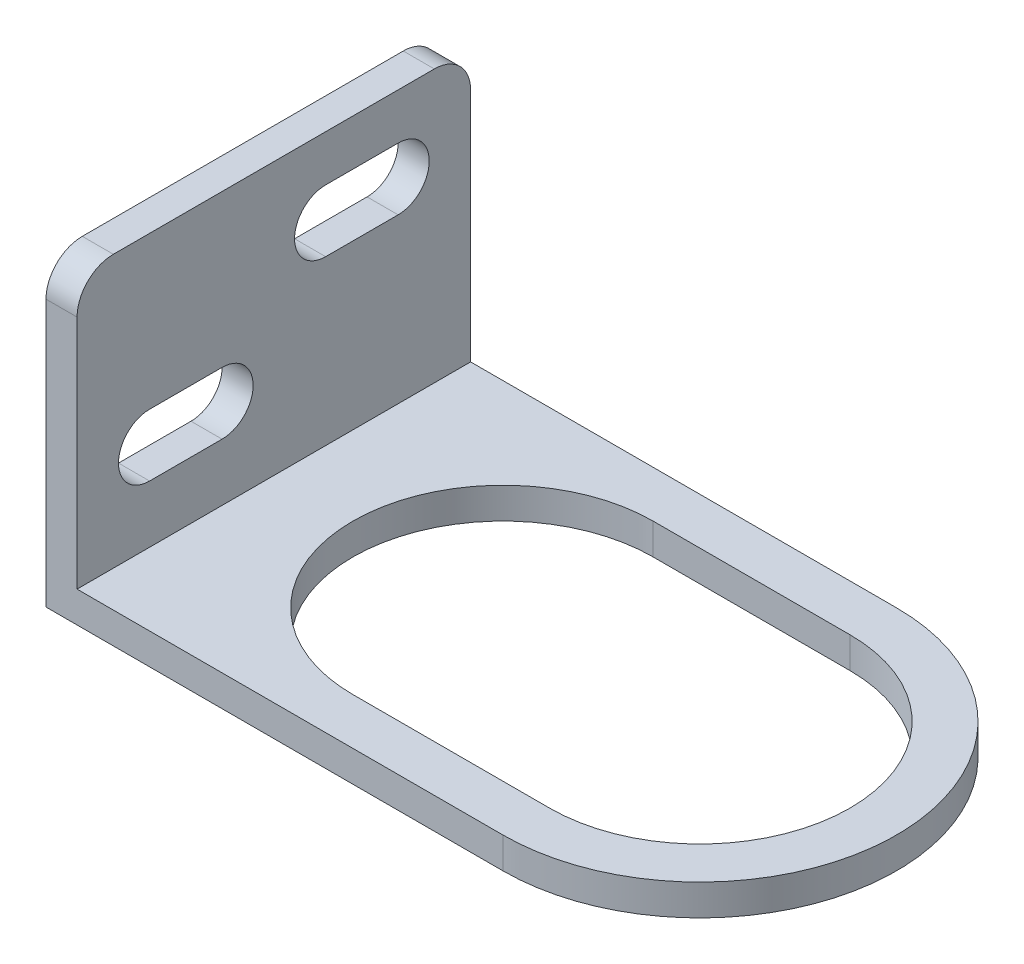
ISO-10303-21;
HEADER;
FILE_DESCRIPTION(('STEP AP214'),'2;1');
FILE_NAME('part.step','',(''),(''),'','','');
FILE_SCHEMA(('AUTOMOTIVE_DESIGN { 1 0 10303 214 1 1 1 1 }'));
ENDSEC;
DATA;
#1=APPLICATION_CONTEXT('core data for automotive mechanical design processes');
#2=APPLICATION_PROTOCOL_DEFINITION('international standard','automotive_design',2000,#1);
#3=PRODUCT_CONTEXT('',#1,'mechanical');
#4=PRODUCT('Part','Part','',(#3));
#5=PRODUCT_RELATED_PRODUCT_CATEGORY('part','',(#4));
#6=PRODUCT_DEFINITION_FORMATION('','',#4);
#7=PRODUCT_DEFINITION_CONTEXT('part definition',#1,'design');
#8=PRODUCT_DEFINITION('design','',#6,#7);
#9=PRODUCT_DEFINITION_SHAPE('','',#8);
#10=(LENGTH_UNIT() NAMED_UNIT(*) SI_UNIT(.MILLI.,.METRE.));
#11=(NAMED_UNIT(*) PLANE_ANGLE_UNIT() SI_UNIT($,.RADIAN.));
#12=(NAMED_UNIT(*) SI_UNIT($,.STERADIAN.) SOLID_ANGLE_UNIT());
#13=UNCERTAINTY_MEASURE_WITH_UNIT(LENGTH_MEASURE(1.E-05),#10,'distance_accuracy_value','');
#14=(GEOMETRIC_REPRESENTATION_CONTEXT(3) GLOBAL_UNCERTAINTY_ASSIGNED_CONTEXT((#13)) GLOBAL_UNIT_ASSIGNED_CONTEXT((#10,
#11,#12)) REPRESENTATION_CONTEXT('',''));
#15=CARTESIAN_POINT('',(0.,0.,0.));
#16=DIRECTION('',(0.,0.,1.));
#17=DIRECTION('',(1.,0.,0.));
#18=AXIS2_PLACEMENT_3D('',#15,#16,#17);
#19=CARTESIAN_POINT('',(0.,0.,19.));
#20=DIRECTION('',(0.,0.,-1.));
#21=DIRECTION('',(-1.,0.,0.));
#22=AXIS2_PLACEMENT_3D('',#19,#20,#21);
#23=PLANE('',#22);
#24=DIRECTION('',(0.,1.,0.));
#25=VECTOR('',#24,1.);
#26=CARTESIAN_POINT('',(42.625671960899,-8.5,19.));
#27=LINE('',#26,#25);
#28=CARTESIAN_POINT('',(42.625671960899,-1.5,19.));
#29=VERTEX_POINT('',#28);
#30=CARTESIAN_POINT('',(42.625671960899,1.5,19.));
#31=VERTEX_POINT('',#30);
#32=EDGE_CURVE('E182',#29,#31,#27,.T.);
#33=ORIENTED_EDGE('',*,*,#32,.T.);
#34=DIRECTION('',(1.,0.,0.));
#35=VECTOR('',#34,1.);
#36=CARTESIAN_POINT('',(0.,1.5,19.));
#37=LINE('',#36,#35);
#38=CARTESIAN_POINT('',(1.5,1.5,19.));
#39=VERTEX_POINT('',#38);
#40=EDGE_CURVE('E181',#39,#31,#37,.T.);
#41=ORIENTED_EDGE('',*,*,#40,.F.);
#42=DIRECTION('',(0.,-1.,0.));
#43=VECTOR('',#42,1.);
#44=CARTESIAN_POINT('',(1.5,32.,19.));
#45=LINE('',#44,#43);
#46=CARTESIAN_POINT('',(1.5,24.2461484812615,19.));
#47=VERTEX_POINT('',#46);
#48=EDGE_CURVE('E208',#47,#39,#45,.T.);
#49=ORIENTED_EDGE('',*,*,#48,.F.);
#50=DIRECTION('',(1.,0.,0.));
#51=VECTOR('',#50,1.);
#52=CARTESIAN_POINT('',(-1.5,24.2461484812615,19.));
#53=LINE('',#52,#51);
#54=CARTESIAN_POINT('',(-1.5,24.2461484812615,19.));
#55=VERTEX_POINT('',#54);
#56=EDGE_CURVE('E219',#55,#47,#53,.T.);
#57=ORIENTED_EDGE('',*,*,#56,.F.);
#58=DIRECTION('',(0.,-1.,0.));
#59=VECTOR('',#58,1.);
#60=CARTESIAN_POINT('',(-1.5,32.,19.));
#61=LINE('',#60,#59);
#62=CARTESIAN_POINT('',(-1.5,-1.5,19.));
#63=VERTEX_POINT('',#62);
#64=EDGE_CURVE('E201',#55,#63,#61,.T.);
#65=ORIENTED_EDGE('',*,*,#64,.T.);
#66=DIRECTION('',(1.,0.,0.));
#67=VECTOR('',#66,1.);
#68=CARTESIAN_POINT('',(0.,-1.5,19.));
#69=LINE('',#68,#67);
#70=EDGE_CURVE('E198',#63,#29,#69,.T.);
#71=ORIENTED_EDGE('',*,*,#70,.T.);
#72=EDGE_LOOP('',(#33,#41,#49,#57,#65,#71));
#73=FACE_BOUND('',#72,.T.);
#74=ADVANCED_FACE('F32',(#73),#23,.F.);
#75=CARTESIAN_POINT('',(0.,0.,-19.));
#76=DIRECTION('',(0.,0.,-1.));
#77=DIRECTION('',(-1.,0.,0.));
#78=AXIS2_PLACEMENT_3D('',#75,#76,#77);
#79=PLANE('',#78);
#80=DIRECTION('',(1.,0.,0.));
#81=VECTOR('',#80,1.);
#82=CARTESIAN_POINT('',(0.,1.5,-19.));
#83=LINE('',#82,#81);
#84=CARTESIAN_POINT('',(1.5,1.5,-19.));
#85=VERTEX_POINT('',#84);
#86=CARTESIAN_POINT('',(42.625671960899,1.5,-19.));
#87=VERTEX_POINT('',#86);
#88=EDGE_CURVE('E179',#85,#87,#83,.T.);
#89=ORIENTED_EDGE('',*,*,#88,.T.);
#90=DIRECTION('',(0.,1.,0.));
#91=VECTOR('',#90,1.);
#92=CARTESIAN_POINT('',(42.625671960899,-8.5,-19.));
#93=LINE('',#92,#91);
#94=CARTESIAN_POINT('',(42.625671960899,-1.5,-19.));
#95=VERTEX_POINT('',#94);
#96=EDGE_CURVE('E11',#87,#95,#93,.F.);
#97=ORIENTED_EDGE('',*,*,#96,.T.);
#98=DIRECTION('',(1.,0.,0.));
#99=VECTOR('',#98,1.);
#100=CARTESIAN_POINT('',(0.,-1.5,-19.));
#101=LINE('',#100,#99);
#102=CARTESIAN_POINT('',(-1.5,-1.5,-19.));
#103=VERTEX_POINT('',#102);
#104=EDGE_CURVE('E189',#103,#95,#101,.T.);
#105=ORIENTED_EDGE('',*,*,#104,.F.);
#106=DIRECTION('',(0.,-1.,0.));
#107=VECTOR('',#106,1.);
#108=CARTESIAN_POINT('',(-1.5,32.,-19.));
#109=LINE('',#108,#107);
#110=CARTESIAN_POINT('',(-1.5,24.2461484812615,-19.));
#111=VERTEX_POINT('',#110);
#112=EDGE_CURVE('E191',#111,#103,#109,.T.);
#113=ORIENTED_EDGE('',*,*,#112,.F.);
#114=DIRECTION('',(1.,0.,0.));
#115=VECTOR('',#114,1.);
#116=CARTESIAN_POINT('',(-1.5,24.2461484812615,-19.));
#117=LINE('',#116,#115);
#118=CARTESIAN_POINT('',(1.5,24.2461484812615,-19.));
#119=VERTEX_POINT('',#118);
#120=EDGE_CURVE('E274',#111,#119,#117,.T.);
#121=ORIENTED_EDGE('',*,*,#120,.T.);
#122=DIRECTION('',(0.,-1.,0.));
#123=VECTOR('',#122,1.);
#124=CARTESIAN_POINT('',(1.5,32.,-19.));
#125=LINE('',#124,#123);
#126=EDGE_CURVE('E187',#119,#85,#125,.T.);
#127=ORIENTED_EDGE('',*,*,#126,.T.);
#128=EDGE_LOOP('',(#89,#97,#105,#113,#121,#127));
#129=FACE_BOUND('',#128,.T.);
#130=ADVANCED_FACE('F184',(#129),#79,.T.);
#131=CARTESIAN_POINT('',(0.,-1.5,19.));
#132=DIRECTION('',(0.,1.,0.));
#133=DIRECTION('',(0.,0.,1.));
#134=AXIS2_PLACEMENT_3D('',#131,#132,#133);
#135=PLANE('',#134);
#136=DIRECTION('',(1.,0.,0.));
#137=VECTOR('',#136,1.);
#138=CARTESIAN_POINT('',(0.,-1.5,14.5));
#139=LINE('',#138,#137);
#140=CARTESIAN_POINT('',(23.6256719608991,-1.5,14.5));
#141=VERTEX_POINT('',#140);
#142=CARTESIAN_POINT('',(42.6256719608991,-1.5,14.5));
#143=VERTEX_POINT('',#142);
#144=EDGE_CURVE('E254',#141,#143,#139,.T.);
#145=ORIENTED_EDGE('',*,*,#144,.T.);
#146=CARTESIAN_POINT('',(42.6256719608991,-1.5,0.));
#147=DIRECTION('',(0.,1.,0.));
#148=DIRECTION('',(0.,0.,1.));
#149=AXIS2_PLACEMENT_3D('',#146,#147,#148);
#150=CIRCLE('',#149,14.5);
#151=CARTESIAN_POINT('',(42.6256719608991,-1.5,-14.5));
#152=VERTEX_POINT('',#151);
#153=EDGE_CURVE('E257',#143,#152,#150,.T.);
#154=ORIENTED_EDGE('',*,*,#153,.T.);
#155=DIRECTION('',(-1.,0.,0.));
#156=VECTOR('',#155,1.);
#157=CARTESIAN_POINT('',(0.,-1.5,-14.5));
#158=LINE('',#157,#156);
#159=CARTESIAN_POINT('',(23.6256719608991,-1.5,-14.5));
#160=VERTEX_POINT('',#159);
#161=EDGE_CURVE('E243',#152,#160,#158,.T.);
#162=ORIENTED_EDGE('',*,*,#161,.T.);
#163=CARTESIAN_POINT('',(23.6256719608991,-1.5,0.));
#164=DIRECTION('',(0.,1.,0.));
#165=DIRECTION('',(0.,0.,1.));
#166=AXIS2_PLACEMENT_3D('',#163,#164,#165);
#167=CIRCLE('',#166,14.5);
#168=EDGE_CURVE('E251',#160,#141,#167,.T.);
#169=ORIENTED_EDGE('',*,*,#168,.T.);
#170=EDGE_LOOP('',(#145,#154,#162,#169));
#171=FACE_BOUND('',#170,.T.);
#172=ORIENTED_EDGE('',*,*,#104,.T.);
#173=CARTESIAN_POINT('',(42.625671960899,-1.5,0.));
#174=DIRECTION('',(0.,1.,0.));
#175=DIRECTION('',(0.,0.,1.));
#176=AXIS2_PLACEMENT_3D('',#173,#174,#175);
#177=CIRCLE('',#176,19.);
#178=EDGE_CURVE('E47',#95,#29,#177,.F.);
#179=ORIENTED_EDGE('',*,*,#178,.T.);
#180=ORIENTED_EDGE('',*,*,#70,.F.);
#181=DIRECTION('',(0.,0.,-1.));
#182=VECTOR('',#181,1.);
#183=CARTESIAN_POINT('',(-1.5,-1.5,19.));
#184=LINE('',#183,#182);
#185=EDGE_CURVE('E199',#63,#103,#184,.T.);
#186=ORIENTED_EDGE('',*,*,#185,.T.);
#187=EDGE_LOOP('',(#172,#179,#180,#186));
#188=FACE_BOUND('',#187,.T.);
#189=ADVANCED_FACE('F34',(#171,#188),#135,.F.);
#190=CARTESIAN_POINT('',(0.,1.5,19.));
#191=DIRECTION('',(0.,1.,0.));
#192=DIRECTION('',(0.,0.,1.));
#193=AXIS2_PLACEMENT_3D('',#190,#191,#192);
#194=PLANE('',#193);
#195=CARTESIAN_POINT('',(42.625671960899,1.5,0.));
#196=DIRECTION('',(0.,-1.,0.));
#197=DIRECTION('',(0.,0.,-1.));
#198=AXIS2_PLACEMENT_3D('',#195,#196,#197);
#199=CIRCLE('',#198,19.);
#200=EDGE_CURVE('E167',#87,#31,#199,.T.);
#201=ORIENTED_EDGE('',*,*,#200,.F.);
#202=ORIENTED_EDGE('',*,*,#88,.F.);
#203=DIRECTION('',(0.,0.,-1.));
#204=VECTOR('',#203,1.);
#205=CARTESIAN_POINT('',(1.5,1.5,19.));
#206=LINE('',#205,#204);
#207=EDGE_CURVE('E40',#39,#85,#206,.T.);
#208=ORIENTED_EDGE('',*,*,#207,.F.);
#209=ORIENTED_EDGE('',*,*,#40,.T.);
#210=EDGE_LOOP('',(#201,#202,#208,#209));
#211=FACE_BOUND('',#210,.T.);
#212=CARTESIAN_POINT('',(42.6256719608991,1.5,0.));
#213=DIRECTION('',(0.,1.,0.));
#214=DIRECTION('',(0.,0.,1.));
#215=AXIS2_PLACEMENT_3D('',#212,#213,#214);
#216=CIRCLE('',#215,14.5);
#217=CARTESIAN_POINT('',(42.6256719608991,1.5,14.5));
#218=VERTEX_POINT('',#217);
#219=CARTESIAN_POINT('',(42.6256719608991,1.5,-14.5));
#220=VERTEX_POINT('',#219);
#221=EDGE_CURVE('E227',#218,#220,#216,.T.);
#222=ORIENTED_EDGE('',*,*,#221,.F.);
#223=DIRECTION('',(1.,0.,0.));
#224=VECTOR('',#223,1.);
#225=CARTESIAN_POINT('',(42.6256719608991,1.5,14.5));
#226=LINE('',#225,#224);
#227=CARTESIAN_POINT('',(23.6256719608991,1.5,14.5));
#228=VERTEX_POINT('',#227);
#229=EDGE_CURVE('E237',#228,#218,#226,.T.);
#230=ORIENTED_EDGE('',*,*,#229,.F.);
#231=CARTESIAN_POINT('',(23.6256719608991,1.5,0.));
#232=DIRECTION('',(0.,1.,0.));
#233=DIRECTION('',(0.,0.,1.));
#234=AXIS2_PLACEMENT_3D('',#231,#232,#233);
#235=CIRCLE('',#234,14.5);
#236=CARTESIAN_POINT('',(23.6256719608991,1.5,-14.5));
#237=VERTEX_POINT('',#236);
#238=EDGE_CURVE('E234',#237,#228,#235,.T.);
#239=ORIENTED_EDGE('',*,*,#238,.F.);
#240=DIRECTION('',(-1.,0.,0.));
#241=VECTOR('',#240,1.);
#242=CARTESIAN_POINT('',(42.6256719608991,1.5,-14.5));
#243=LINE('',#242,#241);
#244=EDGE_CURVE('E229',#220,#237,#243,.T.);
#245=ORIENTED_EDGE('',*,*,#244,.F.);
#246=EDGE_LOOP('',(#222,#230,#239,#245));
#247=FACE_BOUND('',#246,.T.);
#248=ADVANCED_FACE('F176',(#211,#247),#194,.T.);
#249=CARTESIAN_POINT('',(1.5,32.,19.));
#250=DIRECTION('',(1.,0.,0.));
#251=DIRECTION('',(0.,1.,0.));
#252=AXIS2_PLACEMENT_3D('',#249,#250,#251);
#253=PLANE('',#252);
#254=CARTESIAN_POINT('',(1.5,24.2461484812615,-15.4965376918515));
#255=DIRECTION('',(-1.,0.,0.));
#256=DIRECTION('',(0.,1.,0.));
#257=AXIS2_PLACEMENT_3D('',#254,#255,#256);
#258=CIRCLE('',#257,3.50346230814845);
#259=CARTESIAN_POINT('',(1.5,27.74961078941,-15.4965376918515));
#260=VERTEX_POINT('',#259);
#261=EDGE_CURVE('E264',#260,#119,#258,.T.);
#262=ORIENTED_EDGE('',*,*,#261,.F.);
#263=DIRECTION('',(0.,0.,-1.));
#264=VECTOR('',#263,1.);
#265=CARTESIAN_POINT('',(1.5,27.74961078941,15.4965376918515));
#266=LINE('',#265,#264);
#267=CARTESIAN_POINT('',(1.5,27.74961078941,15.4965376918515));
#268=VERTEX_POINT('',#267);
#269=EDGE_CURVE('E270',#268,#260,#266,.T.);
#270=ORIENTED_EDGE('',*,*,#269,.F.);
#271=CARTESIAN_POINT('',(1.5,24.2461484812615,15.4965376918515));
#272=DIRECTION('',(-1.,0.,0.));
#273=DIRECTION('',(0.,-1.,0.));
#274=AXIS2_PLACEMENT_3D('',#271,#272,#273);
#275=CIRCLE('',#274,3.50346230814845);
#276=EDGE_CURVE('E260',#47,#268,#275,.T.);
#277=ORIENTED_EDGE('',*,*,#276,.F.);
#278=ORIENTED_EDGE('',*,*,#48,.T.);
#279=ORIENTED_EDGE('',*,*,#207,.T.);
#280=ORIENTED_EDGE('',*,*,#126,.F.);
#281=EDGE_LOOP('',(#262,#270,#277,#278,#279,#280));
#282=FACE_BOUND('',#281,.T.);
#283=CARTESIAN_POINT('',(1.5,10.0399290298854,12.));
#284=DIRECTION('',(1.,0.,0.));
#285=DIRECTION('',(0.,1.,0.));
#286=AXIS2_PLACEMENT_3D('',#283,#284,#285);
#287=CIRCLE('',#286,3.);
#288=CARTESIAN_POINT('',(1.5,13.0399290298854,12.));
#289=VERTEX_POINT('',#288);
#290=CARTESIAN_POINT('',(1.5,7.03992902988541,12.));
#291=VERTEX_POINT('',#290);
#292=EDGE_CURVE('E276',#289,#291,#287,.T.);
#293=ORIENTED_EDGE('',*,*,#292,.F.);
#294=DIRECTION('',(0.,0.,1.));
#295=VECTOR('',#294,1.);
#296=CARTESIAN_POINT('',(1.5,13.0399290298854,12.));
#297=LINE('',#296,#295);
#298=CARTESIAN_POINT('',(1.5,13.0399290298854,5.));
#299=VERTEX_POINT('',#298);
#300=EDGE_CURVE('E286',#299,#289,#297,.T.);
#301=ORIENTED_EDGE('',*,*,#300,.F.);
#302=CARTESIAN_POINT('',(1.5,10.0399290298854,5.));
#303=DIRECTION('',(1.,0.,0.));
#304=DIRECTION('',(0.,1.,0.));
#305=AXIS2_PLACEMENT_3D('',#302,#303,#304);
#306=CIRCLE('',#305,3.);
#307=CARTESIAN_POINT('',(1.5,7.03992902988541,5.));
#308=VERTEX_POINT('',#307);
#309=EDGE_CURVE('E300',#308,#299,#306,.T.);
#310=ORIENTED_EDGE('',*,*,#309,.F.);
#311=DIRECTION('',(0.,0.,-1.));
#312=VECTOR('',#311,1.);
#313=CARTESIAN_POINT('',(1.5,7.03992902988541,12.));
#314=LINE('',#313,#312);
#315=EDGE_CURVE('E297',#291,#308,#314,.T.);
#316=ORIENTED_EDGE('',*,*,#315,.F.);
#317=EDGE_LOOP('',(#293,#301,#310,#316));
#318=FACE_BOUND('',#317,.T.);
#319=CARTESIAN_POINT('',(1.5,20.2986080282293,-5.));
#320=DIRECTION('',(1.,0.,0.));
#321=DIRECTION('',(0.,1.,0.));
#322=AXIS2_PLACEMENT_3D('',#319,#320,#321);
#323=CIRCLE('',#322,3.);
#324=CARTESIAN_POINT('',(1.5,23.2986080282293,-5.));
#325=VERTEX_POINT('',#324);
#326=CARTESIAN_POINT('',(1.5,17.2986080282293,-5.));
#327=VERTEX_POINT('',#326);
#328=EDGE_CURVE('E307',#325,#327,#323,.T.);
#329=ORIENTED_EDGE('',*,*,#328,.F.);
#330=DIRECTION('',(0.,0.,1.));
#331=VECTOR('',#330,1.);
#332=CARTESIAN_POINT('',(1.5,23.2986080282293,-5.));
#333=LINE('',#332,#331);
#334=CARTESIAN_POINT('',(1.5,23.2986080282293,-12.));
#335=VERTEX_POINT('',#334);
#336=EDGE_CURVE('E318',#335,#325,#333,.T.);
#337=ORIENTED_EDGE('',*,*,#336,.F.);
#338=CARTESIAN_POINT('',(1.5,20.2986080282293,-12.));
#339=DIRECTION('',(1.,0.,0.));
#340=DIRECTION('',(0.,1.,0.));
#341=AXIS2_PLACEMENT_3D('',#338,#339,#340);
#342=CIRCLE('',#341,3.);
#343=CARTESIAN_POINT('',(1.5,17.2986080282293,-12.));
#344=VERTEX_POINT('',#343);
#345=EDGE_CURVE('E332',#344,#335,#342,.T.);
#346=ORIENTED_EDGE('',*,*,#345,.F.);
#347=DIRECTION('',(0.,0.,-1.));
#348=VECTOR('',#347,1.);
#349=CARTESIAN_POINT('',(1.5,17.2986080282293,-5.));
#350=LINE('',#349,#348);
#351=EDGE_CURVE('E329',#327,#344,#350,.T.);
#352=ORIENTED_EDGE('',*,*,#351,.F.);
#353=EDGE_LOOP('',(#329,#337,#346,#352));
#354=FACE_BOUND('',#353,.T.);
#355=ADVANCED_FACE('F204',(#282,#318,#354),#253,.T.);
#356=CARTESIAN_POINT('',(-1.5,32.,19.));
#357=DIRECTION('',(1.,0.,0.));
#358=DIRECTION('',(0.,1.,0.));
#359=AXIS2_PLACEMENT_3D('',#356,#357,#358);
#360=PLANE('',#359);
#361=DIRECTION('',(0.,0.,1.));
#362=VECTOR('',#361,1.);
#363=CARTESIAN_POINT('',(-1.5,13.0399290298854,12.));
#364=LINE('',#363,#362);
#365=CARTESIAN_POINT('',(-1.5,13.0399290298854,5.));
#366=VERTEX_POINT('',#365);
#367=CARTESIAN_POINT('',(-1.5,13.0399290298854,12.));
#368=VERTEX_POINT('',#367);
#369=EDGE_CURVE('E292',#366,#368,#364,.T.);
#370=ORIENTED_EDGE('',*,*,#369,.T.);
#371=CARTESIAN_POINT('',(-1.5,10.0399290298854,12.));
#372=DIRECTION('',(1.,0.,0.));
#373=DIRECTION('',(0.,1.,0.));
#374=AXIS2_PLACEMENT_3D('',#371,#372,#373);
#375=CIRCLE('',#374,3.);
#376=CARTESIAN_POINT('',(-1.5,7.03992902988541,12.));
#377=VERTEX_POINT('',#376);
#378=EDGE_CURVE('E282',#368,#377,#375,.T.);
#379=ORIENTED_EDGE('',*,*,#378,.T.);
#380=DIRECTION('',(0.,0.,-1.));
#381=VECTOR('',#380,1.);
#382=CARTESIAN_POINT('',(-1.5,7.03992902988541,12.));
#383=LINE('',#382,#381);
#384=CARTESIAN_POINT('',(-1.5,7.03992902988541,5.));
#385=VERTEX_POINT('',#384);
#386=EDGE_CURVE('E285',#377,#385,#383,.T.);
#387=ORIENTED_EDGE('',*,*,#386,.T.);
#388=CARTESIAN_POINT('',(-1.5,10.0399290298854,5.));
#389=DIRECTION('',(1.,0.,0.));
#390=DIRECTION('',(0.,1.,0.));
#391=AXIS2_PLACEMENT_3D('',#388,#389,#390);
#392=CIRCLE('',#391,3.);
#393=EDGE_CURVE('E289',#385,#366,#392,.T.);
#394=ORIENTED_EDGE('',*,*,#393,.T.);
#395=EDGE_LOOP('',(#370,#379,#387,#394));
#396=FACE_BOUND('',#395,.T.);
#397=DIRECTION('',(0.,0.,1.));
#398=VECTOR('',#397,1.);
#399=CARTESIAN_POINT('',(-1.5,23.2986080282293,-5.));
#400=LINE('',#399,#398);
#401=CARTESIAN_POINT('',(-1.5,23.2986080282293,-12.));
#402=VERTEX_POINT('',#401);
#403=CARTESIAN_POINT('',(-1.5,23.2986080282293,-5.));
#404=VERTEX_POINT('',#403);
#405=EDGE_CURVE('E324',#402,#404,#400,.T.);
#406=ORIENTED_EDGE('',*,*,#405,.T.);
#407=CARTESIAN_POINT('',(-1.5,20.2986080282293,-5.));
#408=DIRECTION('',(1.,0.,0.));
#409=DIRECTION('',(0.,1.,0.));
#410=AXIS2_PLACEMENT_3D('',#407,#408,#409);
#411=CIRCLE('',#410,3.);
#412=CARTESIAN_POINT('',(-1.5,17.2986080282293,-5.));
#413=VERTEX_POINT('',#412);
#414=EDGE_CURVE('E314',#404,#413,#411,.T.);
#415=ORIENTED_EDGE('',*,*,#414,.T.);
#416=DIRECTION('',(0.,0.,-1.));
#417=VECTOR('',#416,1.);
#418=CARTESIAN_POINT('',(-1.5,17.2986080282293,-5.));
#419=LINE('',#418,#417);
#420=CARTESIAN_POINT('',(-1.5,17.2986080282293,-12.));
#421=VERTEX_POINT('',#420);
#422=EDGE_CURVE('E317',#413,#421,#419,.T.);
#423=ORIENTED_EDGE('',*,*,#422,.T.);
#424=CARTESIAN_POINT('',(-1.5,20.2986080282293,-12.));
#425=DIRECTION('',(1.,0.,0.));
#426=DIRECTION('',(0.,1.,0.));
#427=AXIS2_PLACEMENT_3D('',#424,#425,#426);
#428=CIRCLE('',#427,3.);
#429=EDGE_CURVE('E321',#421,#402,#428,.T.);
#430=ORIENTED_EDGE('',*,*,#429,.T.);
#431=EDGE_LOOP('',(#406,#415,#423,#430));
#432=FACE_BOUND('',#431,.T.);
#433=DIRECTION('',(0.,0.,-1.));
#434=VECTOR('',#433,1.);
#435=CARTESIAN_POINT('',(-1.5,27.74961078941,15.4965376918515));
#436=LINE('',#435,#434);
#437=CARTESIAN_POINT('',(-1.5,27.74961078941,15.4965376918515));
#438=VERTEX_POINT('',#437);
#439=CARTESIAN_POINT('',(-1.5,27.74961078941,-15.4965376918515));
#440=VERTEX_POINT('',#439);
#441=EDGE_CURVE('E263',#438,#440,#436,.T.);
#442=ORIENTED_EDGE('',*,*,#441,.T.);
#443=CARTESIAN_POINT('',(-1.5,24.2461484812615,-15.4965376918515));
#444=DIRECTION('',(-1.,0.,0.));
#445=DIRECTION('',(0.,1.,0.));
#446=AXIS2_PLACEMENT_3D('',#443,#444,#445);
#447=CIRCLE('',#446,3.50346230814845);
#448=EDGE_CURVE('E266',#440,#111,#447,.T.);
#449=ORIENTED_EDGE('',*,*,#448,.T.);
#450=ORIENTED_EDGE('',*,*,#112,.T.);
#451=ORIENTED_EDGE('',*,*,#185,.F.);
#452=ORIENTED_EDGE('',*,*,#64,.F.);
#453=CARTESIAN_POINT('',(-1.5,24.2461484812615,15.4965376918515));
#454=DIRECTION('',(-1.,0.,0.));
#455=DIRECTION('',(0.,-1.,0.));
#456=AXIS2_PLACEMENT_3D('',#453,#454,#455);
#457=CIRCLE('',#456,3.50346230814845);
#458=EDGE_CURVE('E261',#55,#438,#457,.T.);
#459=ORIENTED_EDGE('',*,*,#458,.T.);
#460=EDGE_LOOP('',(#442,#449,#450,#451,#452,#459));
#461=FACE_BOUND('',#460,.T.);
#462=ADVANCED_FACE('F223',(#396,#432,#461),#360,.F.);
#463=CARTESIAN_POINT('',(-1.5,20.2986080282293,-5.));
#464=DIRECTION('',(1.,0.,0.));
#465=DIRECTION('',(0.,1.,0.));
#466=AXIS2_PLACEMENT_3D('',#463,#464,#465);
#467=CYLINDRICAL_SURFACE('',#466,3.);
#468=ORIENTED_EDGE('',*,*,#328,.T.);
#469=DIRECTION('',(1.,0.,0.));
#470=VECTOR('',#469,1.);
#471=CARTESIAN_POINT('',(-1.5,17.2986080282293,-5.));
#472=LINE('',#471,#470);
#473=EDGE_CURVE('E327',#413,#327,#472,.T.);
#474=ORIENTED_EDGE('',*,*,#473,.F.);
#475=ORIENTED_EDGE('',*,*,#414,.F.);
#476=DIRECTION('',(1.,0.,0.));
#477=VECTOR('',#476,1.);
#478=CARTESIAN_POINT('',(-1.5,23.2986080282293,-5.));
#479=LINE('',#478,#477);
#480=EDGE_CURVE('E193',#404,#325,#479,.T.);
#481=ORIENTED_EDGE('',*,*,#480,.T.);
#482=EDGE_LOOP('',(#468,#474,#475,#481));
#483=FACE_BOUND('',#482,.T.);
#484=ADVANCED_FACE('F357',(#483),#467,.F.);
#485=CARTESIAN_POINT('',(-1.5,23.2986080282293,-5.));
#486=DIRECTION('',(0.,1.,0.));
#487=DIRECTION('',(0.,0.,1.));
#488=AXIS2_PLACEMENT_3D('',#485,#486,#487);
#489=PLANE('',#488);
#490=ORIENTED_EDGE('',*,*,#336,.T.);
#491=ORIENTED_EDGE('',*,*,#480,.F.);
#492=ORIENTED_EDGE('',*,*,#405,.F.);
#493=DIRECTION('',(1.,0.,0.));
#494=VECTOR('',#493,1.);
#495=CARTESIAN_POINT('',(-1.5,23.2986080282293,-12.));
#496=LINE('',#495,#494);
#497=EDGE_CURVE('E338',#402,#335,#496,.T.);
#498=ORIENTED_EDGE('',*,*,#497,.T.);
#499=EDGE_LOOP('',(#490,#491,#492,#498));
#500=FACE_BOUND('',#499,.T.);
#501=ADVANCED_FACE('F359',(#500),#489,.F.);
#502=CARTESIAN_POINT('',(-1.5,20.2986080282293,-12.));
#503=DIRECTION('',(1.,0.,0.));
#504=DIRECTION('',(0.,1.,0.));
#505=AXIS2_PLACEMENT_3D('',#502,#503,#504);
#506=CYLINDRICAL_SURFACE('',#505,3.);
#507=ORIENTED_EDGE('',*,*,#345,.T.);
#508=ORIENTED_EDGE('',*,*,#497,.F.);
#509=ORIENTED_EDGE('',*,*,#429,.F.);
#510=DIRECTION('',(1.,0.,0.));
#511=VECTOR('',#510,1.);
#512=CARTESIAN_POINT('',(-1.5,17.2986080282293,-12.));
#513=LINE('',#512,#511);
#514=EDGE_CURVE('E340',#421,#344,#513,.T.);
#515=ORIENTED_EDGE('',*,*,#514,.T.);
#516=EDGE_LOOP('',(#507,#508,#509,#515));
#517=FACE_BOUND('',#516,.T.);
#518=ADVANCED_FACE('F354',(#517),#506,.F.);
#519=CARTESIAN_POINT('',(-1.5,17.2986080282293,-5.));
#520=DIRECTION('',(0.,-1.,0.));
#521=DIRECTION('',(0.,0.,-1.));
#522=AXIS2_PLACEMENT_3D('',#519,#520,#521);
#523=PLANE('',#522);
#524=ORIENTED_EDGE('',*,*,#351,.T.);
#525=ORIENTED_EDGE('',*,*,#514,.F.);
#526=ORIENTED_EDGE('',*,*,#422,.F.);
#527=ORIENTED_EDGE('',*,*,#473,.T.);
#528=EDGE_LOOP('',(#524,#525,#526,#527));
#529=FACE_BOUND('',#528,.T.);
#530=ADVANCED_FACE('F345',(#529),#523,.F.);
#531=CARTESIAN_POINT('',(-1.5,10.0399290298854,12.));
#532=DIRECTION('',(1.,0.,0.));
#533=DIRECTION('',(0.,1.,0.));
#534=AXIS2_PLACEMENT_3D('',#531,#532,#533);
#535=CYLINDRICAL_SURFACE('',#534,3.);
#536=ORIENTED_EDGE('',*,*,#292,.T.);
#537=DIRECTION('',(1.,0.,0.));
#538=VECTOR('',#537,1.);
#539=CARTESIAN_POINT('',(-1.5,7.03992902988541,12.));
#540=LINE('',#539,#538);
#541=EDGE_CURVE('E295',#377,#291,#540,.T.);
#542=ORIENTED_EDGE('',*,*,#541,.F.);
#543=ORIENTED_EDGE('',*,*,#378,.F.);
#544=DIRECTION('',(1.,0.,0.));
#545=VECTOR('',#544,1.);
#546=CARTESIAN_POINT('',(-1.5,13.0399290298854,12.));
#547=LINE('',#546,#545);
#548=EDGE_CURVE('E305',#368,#289,#547,.T.);
#549=ORIENTED_EDGE('',*,*,#548,.T.);
#550=EDGE_LOOP('',(#536,#542,#543,#549));
#551=FACE_BOUND('',#550,.T.);
#552=ADVANCED_FACE('F431',(#551),#535,.F.);
#553=CARTESIAN_POINT('',(-1.5,13.0399290298854,12.));
#554=DIRECTION('',(0.,1.,0.));
#555=DIRECTION('',(0.,0.,1.));
#556=AXIS2_PLACEMENT_3D('',#553,#554,#555);
#557=PLANE('',#556);
#558=ORIENTED_EDGE('',*,*,#300,.T.);
#559=ORIENTED_EDGE('',*,*,#548,.F.);
#560=ORIENTED_EDGE('',*,*,#369,.F.);
#561=DIRECTION('',(1.,0.,0.));
#562=VECTOR('',#561,1.);
#563=CARTESIAN_POINT('',(-1.5,13.0399290298854,5.));
#564=LINE('',#563,#562);
#565=EDGE_CURVE('E308',#366,#299,#564,.T.);
#566=ORIENTED_EDGE('',*,*,#565,.T.);
#567=EDGE_LOOP('',(#558,#559,#560,#566));
#568=FACE_BOUND('',#567,.T.);
#569=ADVANCED_FACE('F427',(#568),#557,.F.);
#570=CARTESIAN_POINT('',(-1.5,10.0399290298854,5.));
#571=DIRECTION('',(1.,0.,0.));
#572=DIRECTION('',(0.,1.,0.));
#573=AXIS2_PLACEMENT_3D('',#570,#571,#572);
#574=CYLINDRICAL_SURFACE('',#573,3.);
#575=ORIENTED_EDGE('',*,*,#309,.T.);
#576=ORIENTED_EDGE('',*,*,#565,.F.);
#577=ORIENTED_EDGE('',*,*,#393,.F.);
#578=DIRECTION('',(1.,0.,0.));
#579=VECTOR('',#578,1.);
#580=CARTESIAN_POINT('',(-1.5,7.03992902988541,5.));
#581=LINE('',#580,#579);
#582=EDGE_CURVE('E310',#385,#308,#581,.T.);
#583=ORIENTED_EDGE('',*,*,#582,.T.);
#584=EDGE_LOOP('',(#575,#576,#577,#583));
#585=FACE_BOUND('',#584,.T.);
#586=ADVANCED_FACE('F430',(#585),#574,.F.);
#587=CARTESIAN_POINT('',(-1.5,7.03992902988541,12.));
#588=DIRECTION('',(0.,-1.,0.));
#589=DIRECTION('',(0.,0.,-1.));
#590=AXIS2_PLACEMENT_3D('',#587,#588,#589);
#591=PLANE('',#590);
#592=ORIENTED_EDGE('',*,*,#315,.T.);
#593=ORIENTED_EDGE('',*,*,#582,.F.);
#594=ORIENTED_EDGE('',*,*,#386,.F.);
#595=ORIENTED_EDGE('',*,*,#541,.T.);
#596=EDGE_LOOP('',(#592,#593,#594,#595));
#597=FACE_BOUND('',#596,.T.);
#598=ADVANCED_FACE('F419',(#597),#591,.F.);
#599=CARTESIAN_POINT('',(-1.5,24.2461484812615,-15.4965376918515));
#600=DIRECTION('',(1.,0.,0.));
#601=DIRECTION('',(0.,1.,0.));
#602=AXIS2_PLACEMENT_3D('',#599,#600,#601);
#603=CYLINDRICAL_SURFACE('',#602,3.50346230814845);
#604=ORIENTED_EDGE('',*,*,#261,.T.);
#605=ORIENTED_EDGE('',*,*,#120,.F.);
#606=ORIENTED_EDGE('',*,*,#448,.F.);
#607=DIRECTION('',(1.,0.,0.));
#608=VECTOR('',#607,1.);
#609=CARTESIAN_POINT('',(-1.5,27.74961078941,-15.4965376918515));
#610=LINE('',#609,#608);
#611=EDGE_CURVE('E277',#440,#260,#610,.T.);
#612=ORIENTED_EDGE('',*,*,#611,.T.);
#613=EDGE_LOOP('',(#604,#605,#606,#612));
#614=FACE_BOUND('',#613,.T.);
#615=ADVANCED_FACE('F415',(#614),#603,.T.);
#616=CARTESIAN_POINT('',(-1.5,27.74961078941,15.4965376918515));
#617=DIRECTION('',(0.,-1.,0.));
#618=DIRECTION('',(0.,0.,-1.));
#619=AXIS2_PLACEMENT_3D('',#616,#617,#618);
#620=PLANE('',#619);
#621=ORIENTED_EDGE('',*,*,#269,.T.);
#622=ORIENTED_EDGE('',*,*,#611,.F.);
#623=ORIENTED_EDGE('',*,*,#441,.F.);
#624=DIRECTION('',(1.,0.,0.));
#625=VECTOR('',#624,1.);
#626=CARTESIAN_POINT('',(-1.5,27.74961078941,15.4965376918515));
#627=LINE('',#626,#625);
#628=EDGE_CURVE('E279',#438,#268,#627,.T.);
#629=ORIENTED_EDGE('',*,*,#628,.T.);
#630=EDGE_LOOP('',(#621,#622,#623,#629));
#631=FACE_BOUND('',#630,.T.);
#632=ADVANCED_FACE('F418',(#631),#620,.F.);
#633=CARTESIAN_POINT('',(-1.5,24.2461484812615,15.4965376918515));
#634=DIRECTION('',(1.,0.,0.));
#635=DIRECTION('',(0.,1.,0.));
#636=AXIS2_PLACEMENT_3D('',#633,#634,#635);
#637=CYLINDRICAL_SURFACE('',#636,3.50346230814845);
#638=ORIENTED_EDGE('',*,*,#276,.T.);
#639=ORIENTED_EDGE('',*,*,#628,.F.);
#640=ORIENTED_EDGE('',*,*,#458,.F.);
#641=ORIENTED_EDGE('',*,*,#56,.T.);
#642=EDGE_LOOP('',(#638,#639,#640,#641));
#643=FACE_BOUND('',#642,.T.);
#644=ADVANCED_FACE('F414',(#643),#637,.T.);
#645=CARTESIAN_POINT('',(42.6256719608991,-8.5,0.));
#646=DIRECTION('',(0.,1.,0.));
#647=DIRECTION('',(0.,0.,1.));
#648=AXIS2_PLACEMENT_3D('',#645,#646,#647);
#649=CYLINDRICAL_SURFACE('',#648,14.5);
#650=DIRECTION('',(0.,1.,0.));
#651=VECTOR('',#650,1.);
#652=CARTESIAN_POINT('',(42.6256719608991,-8.5,14.5));
#653=LINE('',#652,#651);
#654=EDGE_CURVE('E241',#143,#218,#653,.T.);
#655=ORIENTED_EDGE('',*,*,#654,.T.);
#656=ORIENTED_EDGE('',*,*,#221,.T.);
#657=DIRECTION('',(0.,1.,0.));
#658=VECTOR('',#657,1.);
#659=CARTESIAN_POINT('',(42.6256719608991,-8.5,-14.5));
#660=LINE('',#659,#658);
#661=EDGE_CURVE('E240',#152,#220,#660,.T.);
#662=ORIENTED_EDGE('',*,*,#661,.F.);
#663=ORIENTED_EDGE('',*,*,#153,.F.);
#664=EDGE_LOOP('',(#655,#656,#662,#663));
#665=FACE_BOUND('',#664,.T.);
#666=ADVANCED_FACE('F400',(#665),#649,.F.);
#667=CARTESIAN_POINT('',(42.6256719608991,-8.5,14.5));
#668=DIRECTION('',(0.,0.,1.));
#669=DIRECTION('',(1.,0.,0.));
#670=AXIS2_PLACEMENT_3D('',#667,#668,#669);
#671=PLANE('',#670);
#672=DIRECTION('',(0.,1.,0.));
#673=VECTOR('',#672,1.);
#674=CARTESIAN_POINT('',(23.6256719608991,-8.5,14.5));
#675=LINE('',#674,#673);
#676=EDGE_CURVE('E244',#141,#228,#675,.T.);
#677=ORIENTED_EDGE('',*,*,#676,.T.);
#678=ORIENTED_EDGE('',*,*,#229,.T.);
#679=ORIENTED_EDGE('',*,*,#654,.F.);
#680=ORIENTED_EDGE('',*,*,#144,.F.);
#681=EDGE_LOOP('',(#677,#678,#679,#680));
#682=FACE_BOUND('',#681,.T.);
#683=ADVANCED_FACE('F391',(#682),#671,.F.);
#684=CARTESIAN_POINT('',(23.6256719608991,-8.5,0.));
#685=DIRECTION('',(0.,1.,0.));
#686=DIRECTION('',(0.,0.,1.));
#687=AXIS2_PLACEMENT_3D('',#684,#685,#686);
#688=CYLINDRICAL_SURFACE('',#687,14.5);
#689=DIRECTION('',(0.,1.,0.));
#690=VECTOR('',#689,1.);
#691=CARTESIAN_POINT('',(23.6256719608991,-8.5,-14.5));
#692=LINE('',#691,#690);
#693=EDGE_CURVE('E54',#160,#237,#692,.T.);
#694=ORIENTED_EDGE('',*,*,#693,.T.);
#695=ORIENTED_EDGE('',*,*,#238,.T.);
#696=ORIENTED_EDGE('',*,*,#676,.F.);
#697=ORIENTED_EDGE('',*,*,#168,.F.);
#698=EDGE_LOOP('',(#694,#695,#696,#697));
#699=FACE_BOUND('',#698,.T.);
#700=ADVANCED_FACE('F393',(#699),#688,.F.);
#701=CARTESIAN_POINT('',(42.6256719608991,-8.5,-14.5));
#702=DIRECTION('',(0.,0.,-1.));
#703=DIRECTION('',(-1.,0.,0.));
#704=AXIS2_PLACEMENT_3D('',#701,#702,#703);
#705=PLANE('',#704);
#706=ORIENTED_EDGE('',*,*,#661,.T.);
#707=ORIENTED_EDGE('',*,*,#244,.T.);
#708=ORIENTED_EDGE('',*,*,#693,.F.);
#709=ORIENTED_EDGE('',*,*,#161,.F.);
#710=EDGE_LOOP('',(#706,#707,#708,#709));
#711=FACE_BOUND('',#710,.T.);
#712=ADVANCED_FACE('F401',(#711),#705,.F.);
#713=CARTESIAN_POINT('',(42.625671960899,-8.5,0.));
#714=DIRECTION('',(0.,1.,0.));
#715=DIRECTION('',(0.,0.,1.));
#716=AXIS2_PLACEMENT_3D('',#713,#714,#715);
#717=CYLINDRICAL_SURFACE('',#716,19.);
#718=ORIENTED_EDGE('',*,*,#96,.F.);
#719=ORIENTED_EDGE('',*,*,#200,.T.);
#720=ORIENTED_EDGE('',*,*,#32,.F.);
#721=ORIENTED_EDGE('',*,*,#178,.F.);
#722=EDGE_LOOP('',(#718,#719,#720,#721));
#723=FACE_BOUND('',#722,.T.);
#724=ADVANCED_FACE('F166',(#723),#717,.T.);
#725=CLOSED_SHELL('',(#74,#130,#189,#248,#355,#462,#484,#501,#518,#530,#552,#569,#586,#598,#615,
#632,#644,#666,#683,#700,#712,#724));
#726=MANIFOLD_SOLID_BREP('B2',#725);
#727=ADVANCED_BREP_SHAPE_REPRESENTATION('',(#18,#726),#14);
#728=SHAPE_DEFINITION_REPRESENTATION(#9,#727);
ENDSEC;
END-ISO-10303-21;
